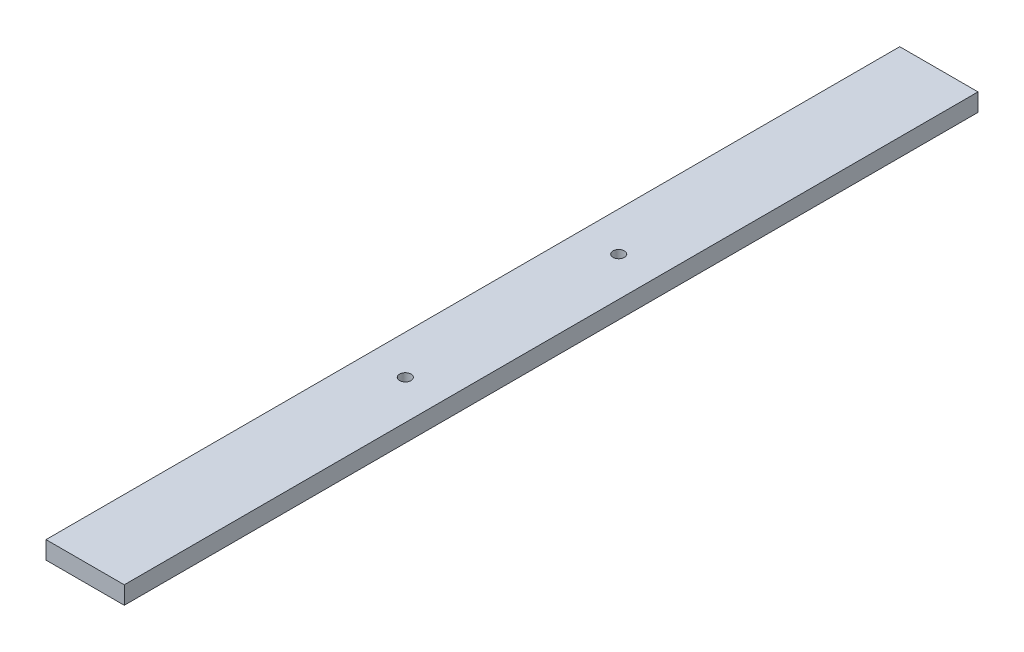
ISO-10303-21;
HEADER;
FILE_DESCRIPTION(('STEP AP214'),'2;1');
FILE_NAME('part.step','',(''),(''),'','','');
FILE_SCHEMA(('AUTOMOTIVE_DESIGN { 1 0 10303 214 1 1 1 1 }'));
ENDSEC;
DATA;
#1=APPLICATION_CONTEXT('core data for automotive mechanical design processes');
#2=APPLICATION_PROTOCOL_DEFINITION('international standard','automotive_design',2000,#1);
#3=PRODUCT_CONTEXT('',#1,'mechanical');
#4=PRODUCT('Part','Part','',(#3));
#5=PRODUCT_RELATED_PRODUCT_CATEGORY('part','',(#4));
#6=PRODUCT_DEFINITION_FORMATION('','',#4);
#7=PRODUCT_DEFINITION_CONTEXT('part definition',#1,'design');
#8=PRODUCT_DEFINITION('design','',#6,#7);
#9=PRODUCT_DEFINITION_SHAPE('','',#8);
#10=(LENGTH_UNIT() NAMED_UNIT(*) SI_UNIT(.MILLI.,.METRE.));
#11=(NAMED_UNIT(*) PLANE_ANGLE_UNIT() SI_UNIT($,.RADIAN.));
#12=(NAMED_UNIT(*) SI_UNIT($,.STERADIAN.) SOLID_ANGLE_UNIT());
#13=UNCERTAINTY_MEASURE_WITH_UNIT(LENGTH_MEASURE(1.E-05),#10,'distance_accuracy_value','');
#14=(GEOMETRIC_REPRESENTATION_CONTEXT(3) GLOBAL_UNCERTAINTY_ASSIGNED_CONTEXT((#13)) GLOBAL_UNIT_ASSIGNED_CONTEXT((#10,
#11,#12)) REPRESENTATION_CONTEXT('',''));
#15=CARTESIAN_POINT('',(0.,0.,0.));
#16=DIRECTION('',(0.,0.,1.));
#17=DIRECTION('',(1.,0.,0.));
#18=AXIS2_PLACEMENT_3D('',#15,#16,#17);
#19=CARTESIAN_POINT('',(11.,-2.5,-240.));
#20=DIRECTION('',(1.,0.,0.));
#21=DIRECTION('',(0.,0.,-1.));
#22=AXIS2_PLACEMENT_3D('',#19,#20,#21);
#23=PLANE('',#22);
#24=DIRECTION('',(0.,1.,0.));
#25=VECTOR('',#24,1.);
#26=CARTESIAN_POINT('',(11.,-2.5,0.));
#27=LINE('',#26,#25);
#28=CARTESIAN_POINT('',(11.,-2.5,0.));
#29=VERTEX_POINT('',#28);
#30=CARTESIAN_POINT('',(11.,2.5,0.));
#31=VERTEX_POINT('',#30);
#32=EDGE_CURVE('E98',#29,#31,#27,.T.);
#33=ORIENTED_EDGE('',*,*,#32,.F.);
#34=DIRECTION('',(0.,0.,1.));
#35=VECTOR('',#34,1.);
#36=CARTESIAN_POINT('',(11.,-2.5,-240.));
#37=LINE('',#36,#35);
#38=CARTESIAN_POINT('',(11.,-2.5,-240.));
#39=VERTEX_POINT('',#38);
#40=EDGE_CURVE('E11',#39,#29,#37,.T.);
#41=ORIENTED_EDGE('',*,*,#40,.F.);
#42=DIRECTION('',(0.,1.,0.));
#43=VECTOR('',#42,1.);
#44=CARTESIAN_POINT('',(11.,-2.5,-240.));
#45=LINE('',#44,#43);
#46=CARTESIAN_POINT('',(11.,2.5,-240.));
#47=VERTEX_POINT('',#46);
#48=EDGE_CURVE('E91',#39,#47,#45,.T.);
#49=ORIENTED_EDGE('',*,*,#48,.T.);
#50=DIRECTION('',(0.,0.,1.));
#51=VECTOR('',#50,1.);
#52=CARTESIAN_POINT('',(11.,2.5,-240.));
#53=LINE('',#52,#51);
#54=EDGE_CURVE('E36',#47,#31,#53,.T.);
#55=ORIENTED_EDGE('',*,*,#54,.T.);
#56=EDGE_LOOP('',(#33,#41,#49,#55));
#57=FACE_BOUND('',#56,.T.);
#58=ADVANCED_FACE('F33',(#57),#23,.T.);
#59=CARTESIAN_POINT('',(-11.,-2.5,-240.));
#60=DIRECTION('',(0.,-1.,0.));
#61=DIRECTION('',(0.,0.,-1.));
#62=AXIS2_PLACEMENT_3D('',#59,#60,#61);
#63=PLANE('',#62);
#64=CARTESIAN_POINT('',(0.,-2.5,-90.));
#65=DIRECTION('',(0.,1.,0.));
#66=DIRECTION('',(0.,0.,-1.));
#67=AXIS2_PLACEMENT_3D('',#64,#65,#66);
#68=CIRCLE('',#67,1.6);
#69=CARTESIAN_POINT('',(0.,-2.5,-91.6));
#70=VERTEX_POINT('',#69);
#71=EDGE_CURVE('E135',#70,#70,#68,.T.);
#72=ORIENTED_EDGE('',*,*,#71,.T.);
#73=EDGE_LOOP('',(#72));
#74=FACE_BOUND('',#73,.T.);
#75=CARTESIAN_POINT('',(0.,-2.5,-150.));
#76=DIRECTION('',(0.,1.,0.));
#77=DIRECTION('',(0.,0.,1.));
#78=AXIS2_PLACEMENT_3D('',#75,#76,#77);
#79=CIRCLE('',#78,1.59999999999999);
#80=CARTESIAN_POINT('',(0.,-2.5,-148.4));
#81=VERTEX_POINT('',#80);
#82=EDGE_CURVE('E102',#81,#81,#79,.T.);
#83=ORIENTED_EDGE('',*,*,#82,.T.);
#84=EDGE_LOOP('',(#83));
#85=FACE_BOUND('',#84,.T.);
#86=DIRECTION('',(1.,0.,0.));
#87=VECTOR('',#86,1.);
#88=CARTESIAN_POINT('',(-11.,-2.5,0.));
#89=LINE('',#88,#87);
#90=CARTESIAN_POINT('',(-11.,-2.5,0.));
#91=VERTEX_POINT('',#90);
#92=EDGE_CURVE('E93',#91,#29,#89,.T.);
#93=ORIENTED_EDGE('',*,*,#92,.F.);
#94=DIRECTION('',(0.,0.,1.));
#95=VECTOR('',#94,1.);
#96=CARTESIAN_POINT('',(-11.,-2.5,-240.));
#97=LINE('',#96,#95);
#98=CARTESIAN_POINT('',(-11.,-2.5,-240.));
#99=VERTEX_POINT('',#98);
#100=EDGE_CURVE('E42',#99,#91,#97,.T.);
#101=ORIENTED_EDGE('',*,*,#100,.F.);
#102=DIRECTION('',(1.,0.,0.));
#103=VECTOR('',#102,1.);
#104=CARTESIAN_POINT('',(-11.,-2.5,-240.));
#105=LINE('',#104,#103);
#106=EDGE_CURVE('E88',#99,#39,#105,.T.);
#107=ORIENTED_EDGE('',*,*,#106,.T.);
#108=ORIENTED_EDGE('',*,*,#40,.T.);
#109=EDGE_LOOP('',(#93,#101,#107,#108));
#110=FACE_BOUND('',#109,.T.);
#111=ADVANCED_FACE('F109',(#74,#85,#110),#63,.T.);
#112=CARTESIAN_POINT('',(-11.,-2.5,-240.));
#113=DIRECTION('',(-1.,0.,0.));
#114=DIRECTION('',(0.,0.,1.));
#115=AXIS2_PLACEMENT_3D('',#112,#113,#114);
#116=PLANE('',#115);
#117=DIRECTION('',(0.,-1.,0.));
#118=VECTOR('',#117,1.);
#119=CARTESIAN_POINT('',(-11.,-2.5,0.));
#120=LINE('',#119,#118);
#121=CARTESIAN_POINT('',(-11.,2.5,0.));
#122=VERTEX_POINT('',#121);
#123=EDGE_CURVE('E83',#122,#91,#120,.T.);
#124=ORIENTED_EDGE('',*,*,#123,.F.);
#125=DIRECTION('',(0.,0.,1.));
#126=VECTOR('',#125,1.);
#127=CARTESIAN_POINT('',(-11.,2.5,-240.));
#128=LINE('',#127,#126);
#129=CARTESIAN_POINT('',(-11.,2.5,-240.));
#130=VERTEX_POINT('',#129);
#131=EDGE_CURVE('E78',#130,#122,#128,.T.);
#132=ORIENTED_EDGE('',*,*,#131,.F.);
#133=DIRECTION('',(0.,-1.,0.));
#134=VECTOR('',#133,1.);
#135=CARTESIAN_POINT('',(-11.,-2.5,-240.));
#136=LINE('',#135,#134);
#137=EDGE_CURVE('E81',#130,#99,#136,.T.);
#138=ORIENTED_EDGE('',*,*,#137,.T.);
#139=ORIENTED_EDGE('',*,*,#100,.T.);
#140=EDGE_LOOP('',(#124,#132,#138,#139));
#141=FACE_BOUND('',#140,.T.);
#142=ADVANCED_FACE('F80',(#141),#116,.T.);
#143=CARTESIAN_POINT('',(-11.,2.5,-240.));
#144=DIRECTION('',(0.,1.,0.));
#145=DIRECTION('',(0.,0.,1.));
#146=AXIS2_PLACEMENT_3D('',#143,#144,#145);
#147=PLANE('',#146);
#148=CARTESIAN_POINT('',(0.,2.5,-90.));
#149=DIRECTION('',(0.,1.,0.));
#150=DIRECTION('',(0.,0.,-1.));
#151=AXIS2_PLACEMENT_3D('',#148,#149,#150);
#152=CIRCLE('',#151,1.6);
#153=CARTESIAN_POINT('',(0.,2.5,-91.6));
#154=VERTEX_POINT('',#153);
#155=EDGE_CURVE('E130',#154,#154,#152,.T.);
#156=ORIENTED_EDGE('',*,*,#155,.F.);
#157=EDGE_LOOP('',(#156));
#158=FACE_BOUND('',#157,.T.);
#159=CARTESIAN_POINT('',(0.,2.5,-150.));
#160=DIRECTION('',(0.,1.,0.));
#161=DIRECTION('',(0.,0.,1.));
#162=AXIS2_PLACEMENT_3D('',#159,#160,#161);
#163=CIRCLE('',#162,1.59999999999999);
#164=CARTESIAN_POINT('',(0.,2.5,-148.4));
#165=VERTEX_POINT('',#164);
#166=EDGE_CURVE('E133',#165,#165,#163,.T.);
#167=ORIENTED_EDGE('',*,*,#166,.F.);
#168=EDGE_LOOP('',(#167));
#169=FACE_BOUND('',#168,.T.);
#170=DIRECTION('',(-1.,0.,0.));
#171=VECTOR('',#170,1.);
#172=CARTESIAN_POINT('',(-11.,2.5,0.));
#173=LINE('',#172,#171);
#174=EDGE_CURVE('E101',#31,#122,#173,.T.);
#175=ORIENTED_EDGE('',*,*,#174,.F.);
#176=ORIENTED_EDGE('',*,*,#54,.F.);
#177=DIRECTION('',(-1.,0.,0.));
#178=VECTOR('',#177,1.);
#179=CARTESIAN_POINT('',(-11.,2.5,-240.));
#180=LINE('',#179,#178);
#181=EDGE_CURVE('E87',#47,#130,#180,.T.);
#182=ORIENTED_EDGE('',*,*,#181,.T.);
#183=ORIENTED_EDGE('',*,*,#131,.T.);
#184=EDGE_LOOP('',(#175,#176,#182,#183));
#185=FACE_BOUND('',#184,.T.);
#186=ADVANCED_FACE('F90',(#158,#169,#185),#147,.T.);
#187=CARTESIAN_POINT('',(0.,0.,-240.));
#188=DIRECTION('',(0.,0.,-1.));
#189=DIRECTION('',(-1.,0.,0.));
#190=AXIS2_PLACEMENT_3D('',#187,#188,#189);
#191=PLANE('',#190);
#192=ORIENTED_EDGE('',*,*,#48,.F.);
#193=ORIENTED_EDGE('',*,*,#106,.F.);
#194=ORIENTED_EDGE('',*,*,#137,.F.);
#195=ORIENTED_EDGE('',*,*,#181,.F.);
#196=EDGE_LOOP('',(#192,#193,#194,#195));
#197=FACE_BOUND('',#196,.T.);
#198=ADVANCED_FACE('F86',(#197),#191,.T.);
#199=CARTESIAN_POINT('',(0.,0.,0.));
#200=DIRECTION('',(0.,0.,-1.));
#201=DIRECTION('',(-1.,0.,0.));
#202=AXIS2_PLACEMENT_3D('',#199,#200,#201);
#203=PLANE('',#202);
#204=ORIENTED_EDGE('',*,*,#32,.T.);
#205=ORIENTED_EDGE('',*,*,#174,.T.);
#206=ORIENTED_EDGE('',*,*,#123,.T.);
#207=ORIENTED_EDGE('',*,*,#92,.T.);
#208=EDGE_LOOP('',(#204,#205,#206,#207));
#209=FACE_BOUND('',#208,.T.);
#210=ADVANCED_FACE('F108',(#209),#203,.F.);
#211=CARTESIAN_POINT('',(0.,-2.5,-150.));
#212=DIRECTION('',(0.,1.,0.));
#213=DIRECTION('',(0.,0.,1.));
#214=AXIS2_PLACEMENT_3D('',#211,#212,#213);
#215=CYLINDRICAL_SURFACE('',#214,1.59999999999999);
#216=ORIENTED_EDGE('',*,*,#82,.F.);
#217=EDGE_LOOP('',(#216));
#218=FACE_BOUND('',#217,.T.);
#219=ORIENTED_EDGE('',*,*,#166,.T.);
#220=EDGE_LOOP('',(#219));
#221=FACE_BOUND('',#220,.T.);
#222=ADVANCED_FACE('F143',(#218,#221),#215,.F.);
#223=CARTESIAN_POINT('',(0.,-2.5,-90.));
#224=DIRECTION('',(0.,1.,0.));
#225=DIRECTION('',(0.,0.,1.));
#226=AXIS2_PLACEMENT_3D('',#223,#224,#225);
#227=CYLINDRICAL_SURFACE('',#226,1.6);
#228=ORIENTED_EDGE('',*,*,#71,.F.);
#229=EDGE_LOOP('',(#228));
#230=FACE_BOUND('',#229,.T.);
#231=ORIENTED_EDGE('',*,*,#155,.T.);
#232=EDGE_LOOP('',(#231));
#233=FACE_BOUND('',#232,.T.);
#234=ADVANCED_FACE('F141',(#230,#233),#227,.F.);
#235=CLOSED_SHELL('',(#58,#111,#142,#186,#198,#210,#222,#234));
#236=MANIFOLD_SOLID_BREP('B2',#235);
#237=ADVANCED_BREP_SHAPE_REPRESENTATION('',(#18,#236),#14);
#238=SHAPE_DEFINITION_REPRESENTATION(#9,#237);
ENDSEC;
END-ISO-10303-21;
